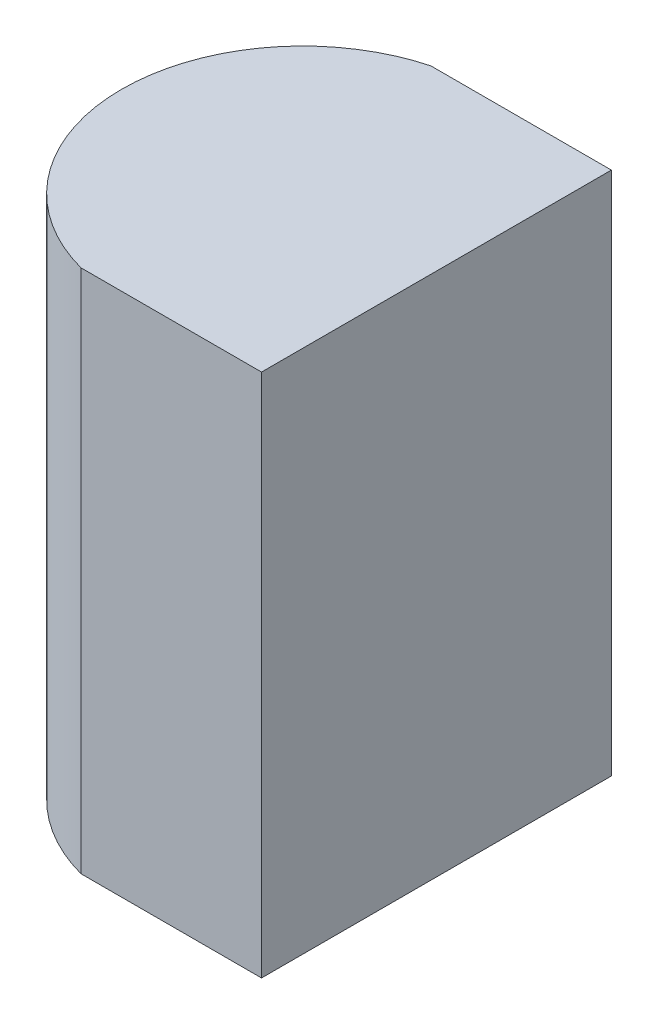
ISO-10303-21;
HEADER;
FILE_DESCRIPTION(('STEP AP214'),'2;1');
FILE_NAME('part.step','',(''),(''),'','','');
FILE_SCHEMA(('AUTOMOTIVE_DESIGN { 1 0 10303 214 1 1 1 1 }'));
ENDSEC;
DATA;
#1=APPLICATION_CONTEXT('core data for automotive mechanical design processes');
#2=APPLICATION_PROTOCOL_DEFINITION('international standard','automotive_design',2000,#1);
#3=PRODUCT_CONTEXT('',#1,'mechanical');
#4=PRODUCT('Part','Part','',(#3));
#5=PRODUCT_RELATED_PRODUCT_CATEGORY('part','',(#4));
#6=PRODUCT_DEFINITION_FORMATION('','',#4);
#7=PRODUCT_DEFINITION_CONTEXT('part definition',#1,'design');
#8=PRODUCT_DEFINITION('design','',#6,#7);
#9=PRODUCT_DEFINITION_SHAPE('','',#8);
#10=(LENGTH_UNIT() NAMED_UNIT(*) SI_UNIT(.MILLI.,.METRE.));
#11=(NAMED_UNIT(*) PLANE_ANGLE_UNIT() SI_UNIT($,.RADIAN.));
#12=(NAMED_UNIT(*) SI_UNIT($,.STERADIAN.) SOLID_ANGLE_UNIT());
#13=UNCERTAINTY_MEASURE_WITH_UNIT(LENGTH_MEASURE(1.E-05),#10,'distance_accuracy_value','');
#14=(GEOMETRIC_REPRESENTATION_CONTEXT(3) GLOBAL_UNCERTAINTY_ASSIGNED_CONTEXT((#13)) GLOBAL_UNIT_ASSIGNED_CONTEXT((#10,
#11,#12)) REPRESENTATION_CONTEXT('',''));
#15=CARTESIAN_POINT('',(0.,0.,0.));
#16=DIRECTION('',(0.,0.,1.));
#17=DIRECTION('',(1.,0.,0.));
#18=AXIS2_PLACEMENT_3D('',#15,#16,#17);
#19=CARTESIAN_POINT('',(0.,6.,0.));
#20=DIRECTION('',(0.,0.,1.));
#21=DIRECTION('',(1.,0.,0.));
#22=AXIS2_PLACEMENT_3D('',#19,#20,#21);
#23=PLANE('',#22);
#24=DIRECTION('',(-1.,0.,0.));
#25=VECTOR('',#24,1.);
#26=CARTESIAN_POINT('',(0.,0.,0.));
#27=LINE('',#26,#25);
#28=CARTESIAN_POINT('',(0.,0.,0.));
#29=VERTEX_POINT('',#28);
#30=CARTESIAN_POINT('',(-2.0637602458033,0.,0.));
#31=VERTEX_POINT('',#30);
#32=EDGE_CURVE('E100',#29,#31,#27,.T.);
#33=ORIENTED_EDGE('',*,*,#32,.T.);
#34=DIRECTION('',(0.,-1.,0.));
#35=VECTOR('',#34,1.);
#36=CARTESIAN_POINT('',(-2.0637602458033,6.,0.));
#37=LINE('',#36,#35);
#38=CARTESIAN_POINT('',(-2.0637602458033,6.,0.));
#39=VERTEX_POINT('',#38);
#40=EDGE_CURVE('E11',#39,#31,#37,.T.);
#41=ORIENTED_EDGE('',*,*,#40,.F.);
#42=DIRECTION('',(-1.,0.,0.));
#43=VECTOR('',#42,1.);
#44=CARTESIAN_POINT('',(0.,6.,0.));
#45=LINE('',#44,#43);
#46=CARTESIAN_POINT('',(0.,6.,0.));
#47=VERTEX_POINT('',#46);
#48=EDGE_CURVE('E88',#47,#39,#45,.T.);
#49=ORIENTED_EDGE('',*,*,#48,.F.);
#50=DIRECTION('',(0.,-1.,0.));
#51=VECTOR('',#50,1.);
#52=CARTESIAN_POINT('',(0.,6.,0.));
#53=LINE('',#52,#51);
#54=EDGE_CURVE('E96',#47,#29,#53,.T.);
#55=ORIENTED_EDGE('',*,*,#54,.T.);
#56=EDGE_LOOP('',(#33,#41,#49,#55));
#57=FACE_BOUND('',#56,.T.);
#58=ADVANCED_FACE('F37',(#57),#23,.F.);
#59=CARTESIAN_POINT('',(-1.53,6.,2.));
#60=DIRECTION('',(0.,-1.,0.));
#61=DIRECTION('',(0.,0.,-1.));
#62=AXIS2_PLACEMENT_3D('',#59,#60,#61);
#63=CYLINDRICAL_SURFACE('',#62,2.07);
#64=CARTESIAN_POINT('',(-1.53,0.,2.));
#65=DIRECTION('',(0.,1.,0.));
#66=DIRECTION('',(0.,0.,1.));
#67=AXIS2_PLACEMENT_3D('',#64,#65,#66);
#68=CIRCLE('',#67,2.07);
#69=CARTESIAN_POINT('',(-2.0637602458033,0.,4.));
#70=VERTEX_POINT('',#69);
#71=EDGE_CURVE('E92',#31,#70,#68,.T.);
#72=ORIENTED_EDGE('',*,*,#71,.T.);
#73=DIRECTION('',(0.,-1.,0.));
#74=VECTOR('',#73,1.);
#75=CARTESIAN_POINT('',(-2.0637602458033,6.,4.));
#76=LINE('',#75,#74);
#77=CARTESIAN_POINT('',(-2.0637602458033,6.,4.));
#78=VERTEX_POINT('',#77);
#79=EDGE_CURVE('E45',#78,#70,#76,.T.);
#80=ORIENTED_EDGE('',*,*,#79,.F.);
#81=CARTESIAN_POINT('',(-1.53,6.,2.));
#82=DIRECTION('',(0.,1.,0.));
#83=DIRECTION('',(0.,0.,1.));
#84=AXIS2_PLACEMENT_3D('',#81,#82,#83);
#85=CIRCLE('',#84,2.07);
#86=EDGE_CURVE('E83',#39,#78,#85,.T.);
#87=ORIENTED_EDGE('',*,*,#86,.F.);
#88=ORIENTED_EDGE('',*,*,#40,.T.);
#89=EDGE_LOOP('',(#72,#80,#87,#88));
#90=FACE_BOUND('',#89,.T.);
#91=ADVANCED_FACE('F91',(#90),#63,.T.);
#92=CARTESIAN_POINT('',(0.,6.,4.));
#93=DIRECTION('',(0.,0.,-1.));
#94=DIRECTION('',(-1.,0.,0.));
#95=AXIS2_PLACEMENT_3D('',#92,#93,#94);
#96=PLANE('',#95);
#97=DIRECTION('',(1.,0.,0.));
#98=VECTOR('',#97,1.);
#99=CARTESIAN_POINT('',(0.,0.,4.));
#100=LINE('',#99,#98);
#101=CARTESIAN_POINT('',(0.,0.,4.));
#102=VERTEX_POINT('',#101);
#103=EDGE_CURVE('E70',#70,#102,#100,.T.);
#104=ORIENTED_EDGE('',*,*,#103,.T.);
#105=DIRECTION('',(0.,-1.,0.));
#106=VECTOR('',#105,1.);
#107=CARTESIAN_POINT('',(0.,6.,4.));
#108=LINE('',#107,#106);
#109=CARTESIAN_POINT('',(0.,6.,4.));
#110=VERTEX_POINT('',#109);
#111=EDGE_CURVE('E93',#110,#102,#108,.T.);
#112=ORIENTED_EDGE('',*,*,#111,.F.);
#113=DIRECTION('',(1.,0.,0.));
#114=VECTOR('',#113,1.);
#115=CARTESIAN_POINT('',(0.,6.,4.));
#116=LINE('',#115,#114);
#117=EDGE_CURVE('E86',#78,#110,#116,.T.);
#118=ORIENTED_EDGE('',*,*,#117,.F.);
#119=ORIENTED_EDGE('',*,*,#79,.T.);
#120=EDGE_LOOP('',(#104,#112,#118,#119));
#121=FACE_BOUND('',#120,.T.);
#122=ADVANCED_FACE('F94',(#121),#96,.F.);
#123=CARTESIAN_POINT('',(0.,6.,0.));
#124=DIRECTION('',(-1.,0.,0.));
#125=DIRECTION('',(0.,0.,1.));
#126=AXIS2_PLACEMENT_3D('',#123,#124,#125);
#127=PLANE('',#126);
#128=DIRECTION('',(0.,0.,-1.));
#129=VECTOR('',#128,1.);
#130=CARTESIAN_POINT('',(0.,0.,0.));
#131=LINE('',#130,#129);
#132=EDGE_CURVE('E76',#102,#29,#131,.T.);
#133=ORIENTED_EDGE('',*,*,#132,.T.);
#134=ORIENTED_EDGE('',*,*,#54,.F.);
#135=DIRECTION('',(0.,0.,-1.));
#136=VECTOR('',#135,1.);
#137=CARTESIAN_POINT('',(0.,6.,0.));
#138=LINE('',#137,#136);
#139=EDGE_CURVE('E53',#110,#47,#138,.T.);
#140=ORIENTED_EDGE('',*,*,#139,.F.);
#141=ORIENTED_EDGE('',*,*,#111,.T.);
#142=EDGE_LOOP('',(#133,#134,#140,#141));
#143=FACE_BOUND('',#142,.T.);
#144=ADVANCED_FACE('F107',(#143),#127,.F.);
#145=CARTESIAN_POINT('',(-1.53,6.,2.));
#146=DIRECTION('',(0.,1.,0.));
#147=DIRECTION('',(0.,0.,1.));
#148=AXIS2_PLACEMENT_3D('',#145,#146,#147);
#149=PLANE('',#148);
#150=ORIENTED_EDGE('',*,*,#48,.T.);
#151=ORIENTED_EDGE('',*,*,#86,.T.);
#152=ORIENTED_EDGE('',*,*,#117,.T.);
#153=ORIENTED_EDGE('',*,*,#139,.T.);
#154=EDGE_LOOP('',(#150,#151,#152,#153));
#155=FACE_BOUND('',#154,.T.);
#156=ADVANCED_FACE('F84',(#155),#149,.T.);
#157=CARTESIAN_POINT('',(-1.53,0.,2.));
#158=DIRECTION('',(0.,1.,0.));
#159=DIRECTION('',(0.,0.,1.));
#160=AXIS2_PLACEMENT_3D('',#157,#158,#159);
#161=PLANE('',#160);
#162=ORIENTED_EDGE('',*,*,#32,.F.);
#163=ORIENTED_EDGE('',*,*,#132,.F.);
#164=ORIENTED_EDGE('',*,*,#103,.F.);
#165=ORIENTED_EDGE('',*,*,#71,.F.);
#166=EDGE_LOOP('',(#162,#163,#164,#165));
#167=FACE_BOUND('',#166,.T.);
#168=ADVANCED_FACE('F110',(#167),#161,.F.);
#169=CLOSED_SHELL('',(#58,#91,#122,#144,#156,#168));
#170=MANIFOLD_SOLID_BREP('B2',#169);
#171=ADVANCED_BREP_SHAPE_REPRESENTATION('',(#18,#170),#14);
#172=SHAPE_DEFINITION_REPRESENTATION(#9,#171);
ENDSEC;
END-ISO-10303-21;
